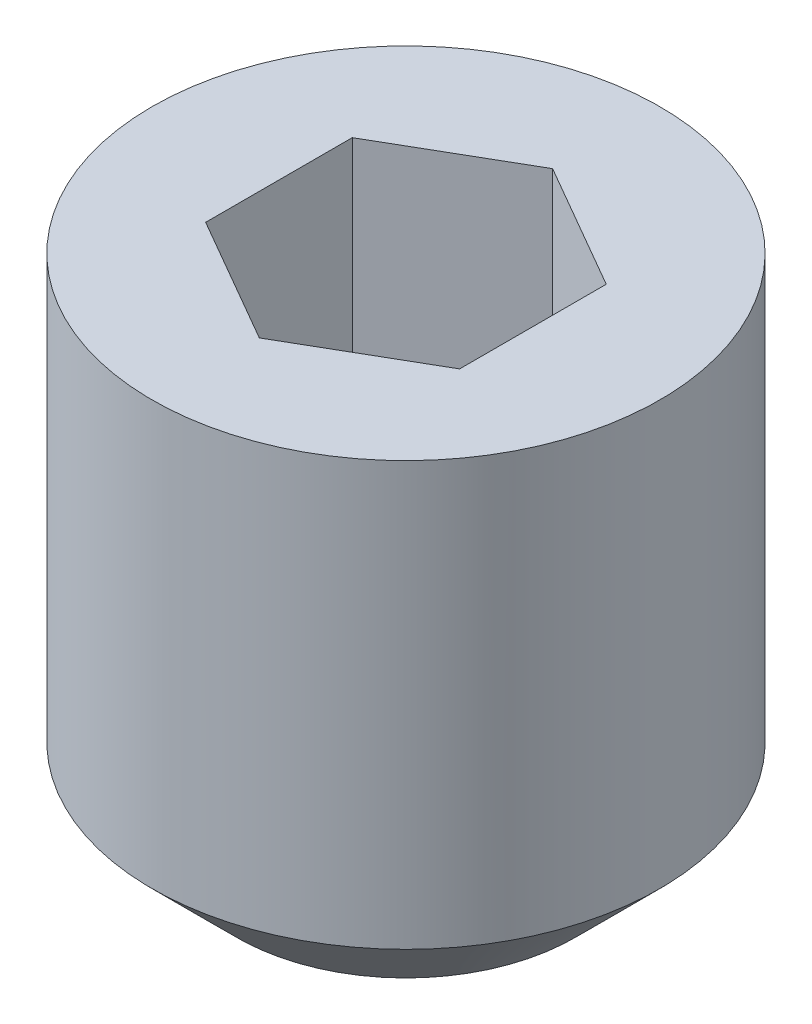
ISO-10303-21;
HEADER;
FILE_DESCRIPTION(('STEP AP214'),'2;1');
FILE_NAME('part.step','',(''),(''),'','','');
FILE_SCHEMA(('AUTOMOTIVE_DESIGN { 1 0 10303 214 1 1 1 1 }'));
ENDSEC;
DATA;
#1=APPLICATION_CONTEXT('core data for automotive mechanical design processes');
#2=APPLICATION_PROTOCOL_DEFINITION('international standard','automotive_design',2000,#1);
#3=PRODUCT_CONTEXT('',#1,'mechanical');
#4=PRODUCT('Part','Part','',(#3));
#5=PRODUCT_RELATED_PRODUCT_CATEGORY('part','',(#4));
#6=PRODUCT_DEFINITION_FORMATION('','',#4);
#7=PRODUCT_DEFINITION_CONTEXT('part definition',#1,'design');
#8=PRODUCT_DEFINITION('design','',#6,#7);
#9=PRODUCT_DEFINITION_SHAPE('','',#8);
#10=(LENGTH_UNIT() NAMED_UNIT(*) SI_UNIT(.MILLI.,.METRE.));
#11=(NAMED_UNIT(*) PLANE_ANGLE_UNIT() SI_UNIT($,.RADIAN.));
#12=(NAMED_UNIT(*) SI_UNIT($,.STERADIAN.) SOLID_ANGLE_UNIT());
#13=UNCERTAINTY_MEASURE_WITH_UNIT(LENGTH_MEASURE(1.E-05),#10,'distance_accuracy_value','');
#14=(GEOMETRIC_REPRESENTATION_CONTEXT(3) GLOBAL_UNCERTAINTY_ASSIGNED_CONTEXT((#13)) GLOBAL_UNIT_ASSIGNED_CONTEXT((#10,
#11,#12)) REPRESENTATION_CONTEXT('',''));
#15=CARTESIAN_POINT('',(0.,0.,0.));
#16=DIRECTION('',(0.,0.,1.));
#17=DIRECTION('',(1.,0.,0.));
#18=AXIS2_PLACEMENT_3D('',#15,#16,#17);
#19=CARTESIAN_POINT('',(0.,3.,0.));
#20=DIRECTION('',(0.,-1.,0.));
#21=DIRECTION('',(1.,0.,0.));
#22=AXIS2_PLACEMENT_3D('',#19,#20,#21);
#23=PLANE('',#22);
#24=CARTESIAN_POINT('',(0.,3.,0.));
#25=DIRECTION('',(0.,1.,0.));
#26=DIRECTION('',(-1.,0.,0.));
#27=AXIS2_PLACEMENT_3D('',#24,#25,#26);
#28=CIRCLE('',#27,1.5);
#29=CARTESIAN_POINT('',(-1.5,3.,0.));
#30=VERTEX_POINT('',#29);
#31=EDGE_CURVE('E11',#30,#30,#28,.T.);
#32=ORIENTED_EDGE('',*,*,#31,.T.);
#33=EDGE_LOOP('',(#32));
#34=FACE_BOUND('',#33,.T.);
#35=DIRECTION('',(-0.866025403784438,0.,0.500000000000001));
#36=VECTOR('',#35,1.);
#37=CARTESIAN_POINT('',(0.,3.,-0.866025403784439));
#38=LINE('',#37,#36);
#39=CARTESIAN_POINT('',(0.,3.,-0.866025403784439));
#40=VERTEX_POINT('',#39);
#41=CARTESIAN_POINT('',(-0.75,3.,-0.433012701892219));
#42=VERTEX_POINT('',#41);
#43=EDGE_CURVE('E183',#40,#42,#38,.T.);
#44=ORIENTED_EDGE('',*,*,#43,.F.);
#45=DIRECTION('',(-0.866025403784439,0.,-0.499999999999999));
#46=VECTOR('',#45,1.);
#47=CARTESIAN_POINT('',(0.75,3.,-0.43301270189222));
#48=LINE('',#47,#46);
#49=CARTESIAN_POINT('',(0.75,3.,-0.43301270189222));
#50=VERTEX_POINT('',#49);
#51=EDGE_CURVE('E57',#50,#40,#48,.T.);
#52=ORIENTED_EDGE('',*,*,#51,.F.);
#53=DIRECTION('',(0.,0.,-1.));
#54=VECTOR('',#53,1.);
#55=CARTESIAN_POINT('',(0.75,3.,0.433012701892219));
#56=LINE('',#55,#54);
#57=CARTESIAN_POINT('',(0.75,3.,0.433012701892219));
#58=VERTEX_POINT('',#57);
#59=EDGE_CURVE('E144',#58,#50,#56,.T.);
#60=ORIENTED_EDGE('',*,*,#59,.F.);
#61=DIRECTION('',(0.866025403784438,0.,-0.5));
#62=VECTOR('',#61,1.);
#63=CARTESIAN_POINT('',(0.,3.,0.866025403784438));
#64=LINE('',#63,#62);
#65=CARTESIAN_POINT('',(0.,3.,0.866025403784438));
#66=VERTEX_POINT('',#65);
#67=EDGE_CURVE('E194',#66,#58,#64,.T.);
#68=ORIENTED_EDGE('',*,*,#67,.F.);
#69=DIRECTION('',(0.866025403784439,0.,0.5));
#70=VECTOR('',#69,1.);
#71=CARTESIAN_POINT('',(-0.75,3.,0.433012701892219));
#72=LINE('',#71,#70);
#73=CARTESIAN_POINT('',(-0.75,3.,0.433012701892219));
#74=VERTEX_POINT('',#73);
#75=EDGE_CURVE('E190',#74,#66,#72,.T.);
#76=ORIENTED_EDGE('',*,*,#75,.F.);
#77=DIRECTION('',(0.,0.,1.));
#78=VECTOR('',#77,1.);
#79=CARTESIAN_POINT('',(-0.75,3.,-0.433012701892219));
#80=LINE('',#79,#78);
#81=EDGE_CURVE('E187',#42,#74,#80,.T.);
#82=ORIENTED_EDGE('',*,*,#81,.F.);
#83=EDGE_LOOP('',(#44,#52,#60,#68,#76,#82));
#84=FACE_BOUND('',#83,.T.);
#85=ADVANCED_FACE('F39',(#34,#84),#23,.F.);
#86=CARTESIAN_POINT('',(0.,3.,0.));
#87=DIRECTION('',(0.,1.,0.));
#88=DIRECTION('',(-1.,0.,0.));
#89=AXIS2_PLACEMENT_3D('',#86,#87,#88);
#90=CYLINDRICAL_SURFACE('',#89,1.5);
#91=CARTESIAN_POINT('',(0.,0.499999999999995,0.));
#92=DIRECTION('',(0.,-1.,0.));
#93=DIRECTION('',(0.,0.,-1.));
#94=AXIS2_PLACEMENT_3D('',#91,#92,#93);
#95=CIRCLE('',#94,1.5);
#96=CARTESIAN_POINT('',(0.,0.499999999999995,-1.5));
#97=VERTEX_POINT('',#96);
#98=EDGE_CURVE('E412',#97,#97,#95,.T.);
#99=ORIENTED_EDGE('',*,*,#98,.F.);
#100=EDGE_LOOP('',(#99));
#101=FACE_BOUND('',#100,.T.);
#102=ORIENTED_EDGE('',*,*,#31,.F.);
#103=EDGE_LOOP('',(#102));
#104=FACE_BOUND('',#103,.T.);
#105=ADVANCED_FACE('F272',(#101,#104),#90,.T.);
#106=CARTESIAN_POINT('',(0.75,1.8,-0.43301270189222));
#107=DIRECTION('',(0.499999999999999,0.,-0.866025403784439));
#108=DIRECTION('',(-0.866025403784439,0.,-0.499999999999999));
#109=AXIS2_PLACEMENT_3D('',#106,#107,#108);
#110=PLANE('',#109);
#111=DIRECTION('',(-0.866025403784439,0.,-0.499999999999999));
#112=VECTOR('',#111,1.);
#113=CARTESIAN_POINT('',(0.75,1.8,-0.43301270189222));
#114=LINE('',#113,#112);
#115=CARTESIAN_POINT('',(0.75,1.8,-0.43301270189222));
#116=VERTEX_POINT('',#115);
#117=CARTESIAN_POINT('',(0.375,1.8,-0.649519052838329));
#118=VERTEX_POINT('',#117);
#119=EDGE_CURVE('E143',#116,#118,#114,.T.);
#120=ORIENTED_EDGE('',*,*,#119,.F.);
#121=DIRECTION('',(0.,1.,0.));
#122=VECTOR('',#121,1.);
#123=CARTESIAN_POINT('',(0.75,1.8,-0.43301270189222));
#124=LINE('',#123,#122);
#125=EDGE_CURVE('E199',#116,#50,#124,.T.);
#126=ORIENTED_EDGE('',*,*,#125,.T.);
#127=ORIENTED_EDGE('',*,*,#51,.T.);
#128=DIRECTION('',(0.,1.,0.));
#129=VECTOR('',#128,1.);
#130=CARTESIAN_POINT('',(0.,1.8,-0.866025403784439));
#131=LINE('',#130,#129);
#132=CARTESIAN_POINT('',(0.,1.8,-0.866025403784439));
#133=VERTEX_POINT('',#132);
#134=EDGE_CURVE('E146',#133,#40,#131,.T.);
#135=ORIENTED_EDGE('',*,*,#134,.F.);
#136=EDGE_CURVE('E134',#118,#133,#114,.T.);
#137=ORIENTED_EDGE('',*,*,#136,.F.);
#138=EDGE_LOOP('',(#120,#126,#127,#135,#137));
#139=FACE_BOUND('',#138,.T.);
#140=ADVANCED_FACE('F147',(#139),#110,.F.);
#141=CARTESIAN_POINT('',(0.75,1.8,0.433012701892219));
#142=DIRECTION('',(1.,0.,0.));
#143=DIRECTION('',(0.,0.,-1.));
#144=AXIS2_PLACEMENT_3D('',#141,#142,#143);
#145=PLANE('',#144);
#146=DIRECTION('',(0.,0.,-1.));
#147=VECTOR('',#146,1.);
#148=CARTESIAN_POINT('',(0.75,1.8,0.433012701892219));
#149=LINE('',#148,#147);
#150=CARTESIAN_POINT('',(0.75,1.8,0.433012701892219));
#151=VERTEX_POINT('',#150);
#152=CARTESIAN_POINT('',(0.75,1.8,0.));
#153=VERTEX_POINT('',#152);
#154=EDGE_CURVE('E152',#151,#153,#149,.T.);
#155=ORIENTED_EDGE('',*,*,#154,.F.);
#156=DIRECTION('',(0.,1.,0.));
#157=VECTOR('',#156,1.);
#158=CARTESIAN_POINT('',(0.75,1.8,0.433012701892219));
#159=LINE('',#158,#157);
#160=EDGE_CURVE('E203',#151,#58,#159,.T.);
#161=ORIENTED_EDGE('',*,*,#160,.T.);
#162=ORIENTED_EDGE('',*,*,#59,.T.);
#163=ORIENTED_EDGE('',*,*,#125,.F.);
#164=EDGE_CURVE('E177',#153,#116,#149,.T.);
#165=ORIENTED_EDGE('',*,*,#164,.F.);
#166=EDGE_LOOP('',(#155,#161,#162,#163,#165));
#167=FACE_BOUND('',#166,.T.);
#168=ADVANCED_FACE('F244',(#167),#145,.F.);
#169=CARTESIAN_POINT('',(0.,1.8,0.866025403784438));
#170=DIRECTION('',(0.500000000000001,0.,0.866025403784438));
#171=DIRECTION('',(0.866025403784438,0.,-0.500000000000001));
#172=AXIS2_PLACEMENT_3D('',#169,#170,#171);
#173=PLANE('',#172);
#174=DIRECTION('',(0.866025403784438,0.,-0.5));
#175=VECTOR('',#174,1.);
#176=CARTESIAN_POINT('',(0.,1.8,0.866025403784438));
#177=LINE('',#176,#175);
#178=CARTESIAN_POINT('',(0.,1.8,0.866025403784438));
#179=VERTEX_POINT('',#178);
#180=CARTESIAN_POINT('',(0.375000000000001,1.8,0.649519052838329));
#181=VERTEX_POINT('',#180);
#182=EDGE_CURVE('E68',#179,#181,#177,.T.);
#183=ORIENTED_EDGE('',*,*,#182,.F.);
#184=DIRECTION('',(0.,1.,0.));
#185=VECTOR('',#184,1.);
#186=CARTESIAN_POINT('',(0.,1.8,0.866025403784438));
#187=LINE('',#186,#185);
#188=EDGE_CURVE('E207',#179,#66,#187,.T.);
#189=ORIENTED_EDGE('',*,*,#188,.T.);
#190=ORIENTED_EDGE('',*,*,#67,.T.);
#191=ORIENTED_EDGE('',*,*,#160,.F.);
#192=EDGE_CURVE('E174',#181,#151,#177,.T.);
#193=ORIENTED_EDGE('',*,*,#192,.F.);
#194=EDGE_LOOP('',(#183,#189,#190,#191,#193));
#195=FACE_BOUND('',#194,.T.);
#196=ADVANCED_FACE('F300',(#195),#173,.F.);
#197=CARTESIAN_POINT('',(-0.75,1.8,0.433012701892219));
#198=DIRECTION('',(-0.5,0.,0.866025403784439));
#199=DIRECTION('',(0.866025403784439,0.,0.5));
#200=AXIS2_PLACEMENT_3D('',#197,#198,#199);
#201=PLANE('',#200);
#202=DIRECTION('',(0.866025403784439,0.,0.5));
#203=VECTOR('',#202,1.);
#204=CARTESIAN_POINT('',(-0.75,1.8,0.433012701892219));
#205=LINE('',#204,#203);
#206=CARTESIAN_POINT('',(-0.75,1.8,0.433012701892219));
#207=VERTEX_POINT('',#206);
#208=CARTESIAN_POINT('',(-0.375,1.8,0.649519052838329));
#209=VERTEX_POINT('',#208);
#210=EDGE_CURVE('E170',#207,#209,#205,.T.);
#211=ORIENTED_EDGE('',*,*,#210,.F.);
#212=DIRECTION('',(0.,1.,0.));
#213=VECTOR('',#212,1.);
#214=CARTESIAN_POINT('',(-0.75,1.8,0.433012701892219));
#215=LINE('',#214,#213);
#216=EDGE_CURVE('E211',#207,#74,#215,.T.);
#217=ORIENTED_EDGE('',*,*,#216,.T.);
#218=ORIENTED_EDGE('',*,*,#75,.T.);
#219=ORIENTED_EDGE('',*,*,#188,.F.);
#220=EDGE_CURVE('E169',#209,#179,#205,.T.);
#221=ORIENTED_EDGE('',*,*,#220,.F.);
#222=EDGE_LOOP('',(#211,#217,#218,#219,#221));
#223=FACE_BOUND('',#222,.T.);
#224=ADVANCED_FACE('F297',(#223),#201,.F.);
#225=CARTESIAN_POINT('',(-0.75,1.8,-0.433012701892219));
#226=DIRECTION('',(-1.,0.,0.));
#227=DIRECTION('',(0.,-1.,0.));
#228=AXIS2_PLACEMENT_3D('',#225,#226,#227);
#229=PLANE('',#228);
#230=DIRECTION('',(0.,0.,1.));
#231=VECTOR('',#230,1.);
#232=CARTESIAN_POINT('',(-0.75,1.8,-0.433012701892219));
#233=LINE('',#232,#231);
#234=CARTESIAN_POINT('',(-0.75,1.8,-0.433012701892219));
#235=VERTEX_POINT('',#234);
#236=CARTESIAN_POINT('',(-0.75,1.8,0.));
#237=VERTEX_POINT('',#236);
#238=EDGE_CURVE('E163',#235,#237,#233,.T.);
#239=ORIENTED_EDGE('',*,*,#238,.F.);
#240=DIRECTION('',(0.,1.,0.));
#241=VECTOR('',#240,1.);
#242=CARTESIAN_POINT('',(-0.75,1.8,-0.433012701892219));
#243=LINE('',#242,#241);
#244=EDGE_CURVE('E151',#235,#42,#243,.T.);
#245=ORIENTED_EDGE('',*,*,#244,.T.);
#246=ORIENTED_EDGE('',*,*,#81,.T.);
#247=ORIENTED_EDGE('',*,*,#216,.F.);
#248=EDGE_CURVE('E159',#237,#207,#233,.T.);
#249=ORIENTED_EDGE('',*,*,#248,.F.);
#250=EDGE_LOOP('',(#239,#245,#246,#247,#249));
#251=FACE_BOUND('',#250,.T.);
#252=ADVANCED_FACE('F255',(#251),#229,.F.);
#253=CARTESIAN_POINT('',(0.,1.8,-0.866025403784439));
#254=DIRECTION('',(-0.500000000000001,0.,-0.866025403784438));
#255=DIRECTION('',(-0.866025403784438,0.,0.500000000000001));
#256=AXIS2_PLACEMENT_3D('',#253,#254,#255);
#257=PLANE('',#256);
#258=DIRECTION('',(-0.866025403784438,0.,0.500000000000001));
#259=VECTOR('',#258,1.);
#260=CARTESIAN_POINT('',(0.,1.8,-0.866025403784439));
#261=LINE('',#260,#259);
#262=CARTESIAN_POINT('',(-0.375,1.8,-0.649519052838329));
#263=VERTEX_POINT('',#262);
#264=EDGE_CURVE('E137',#133,#263,#261,.T.);
#265=ORIENTED_EDGE('',*,*,#264,.F.);
#266=ORIENTED_EDGE('',*,*,#134,.T.);
#267=ORIENTED_EDGE('',*,*,#43,.T.);
#268=ORIENTED_EDGE('',*,*,#244,.F.);
#269=EDGE_CURVE('E157',#263,#235,#261,.T.);
#270=ORIENTED_EDGE('',*,*,#269,.F.);
#271=EDGE_LOOP('',(#265,#266,#267,#268,#270));
#272=FACE_BOUND('',#271,.T.);
#273=ADVANCED_FACE('F155',(#272),#257,.F.);
#274=CARTESIAN_POINT('',(0.,1.8,0.));
#275=DIRECTION('',(0.,1.,0.));
#276=DIRECTION('',(0.,0.,1.));
#277=AXIS2_PLACEMENT_3D('',#274,#275,#276);
#278=PLANE('',#277);
#279=ORIENTED_EDGE('',*,*,#192,.T.);
#280=ORIENTED_EDGE('',*,*,#154,.T.);
#281=CARTESIAN_POINT('',(0.,1.8,0.));
#282=DIRECTION('',(0.,1.,0.));
#283=DIRECTION('',(-1.,0.,0.));
#284=AXIS2_PLACEMENT_3D('',#281,#282,#283);
#285=CIRCLE('',#284,0.75);
#286=EDGE_CURVE('E224',#181,#153,#285,.T.);
#287=ORIENTED_EDGE('',*,*,#286,.F.);
#288=EDGE_LOOP('',(#279,#280,#287));
#289=FACE_BOUND('',#288,.T.);
#290=ADVANCED_FACE('F239',(#289),#278,.T.);
#291=ORIENTED_EDGE('',*,*,#164,.T.);
#292=ORIENTED_EDGE('',*,*,#119,.T.);
#293=EDGE_CURVE('E227',#153,#118,#285,.T.);
#294=ORIENTED_EDGE('',*,*,#293,.F.);
#295=EDGE_LOOP('',(#291,#292,#294));
#296=FACE_BOUND('',#295,.T.);
#297=ADVANCED_FACE('F249',(#296),#278,.T.);
#298=ORIENTED_EDGE('',*,*,#136,.T.);
#299=ORIENTED_EDGE('',*,*,#264,.T.);
#300=EDGE_CURVE('E139',#118,#263,#285,.T.);
#301=ORIENTED_EDGE('',*,*,#300,.F.);
#302=EDGE_LOOP('',(#298,#299,#301));
#303=FACE_BOUND('',#302,.T.);
#304=ADVANCED_FACE('F135',(#303),#278,.T.);
#305=ORIENTED_EDGE('',*,*,#269,.T.);
#306=ORIENTED_EDGE('',*,*,#238,.T.);
#307=EDGE_CURVE('E202',#263,#237,#285,.T.);
#308=ORIENTED_EDGE('',*,*,#307,.F.);
#309=EDGE_LOOP('',(#305,#306,#308));
#310=FACE_BOUND('',#309,.T.);
#311=ADVANCED_FACE('F259',(#310),#278,.T.);
#312=ORIENTED_EDGE('',*,*,#248,.T.);
#313=ORIENTED_EDGE('',*,*,#210,.T.);
#314=EDGE_CURVE('E47',#237,#209,#285,.T.);
#315=ORIENTED_EDGE('',*,*,#314,.F.);
#316=EDGE_LOOP('',(#312,#313,#315));
#317=FACE_BOUND('',#316,.T.);
#318=ADVANCED_FACE('F261',(#317),#278,.T.);
#319=ORIENTED_EDGE('',*,*,#220,.T.);
#320=ORIENTED_EDGE('',*,*,#182,.T.);
#321=EDGE_CURVE('E219',#209,#181,#285,.T.);
#322=ORIENTED_EDGE('',*,*,#321,.F.);
#323=EDGE_LOOP('',(#319,#320,#322));
#324=FACE_BOUND('',#323,.T.);
#325=ADVANCED_FACE('F267',(#324),#278,.T.);
#326=CARTESIAN_POINT('',(0.,1.36698729810778,0.));
#327=DIRECTION('',(0.,1.,0.));
#328=DIRECTION('',(-1.,0.,0.));
#329=AXIS2_PLACEMENT_3D('',#326,#327,#328);
#330=CONICAL_SURFACE('',#329,0.,1.0471975511966);
#331=ORIENTED_EDGE('',*,*,#314,.T.);
#332=ORIENTED_EDGE('',*,*,#321,.T.);
#333=ORIENTED_EDGE('',*,*,#286,.T.);
#334=ORIENTED_EDGE('',*,*,#293,.T.);
#335=ORIENTED_EDGE('',*,*,#300,.T.);
#336=ORIENTED_EDGE('',*,*,#307,.T.);
#337=EDGE_LOOP('',(#331,#332,#333,#334,#335,#336));
#338=FACE_BOUND('',#337,.T.);
#339=CARTESIAN_POINT('',(0.,1.36698729810778,0.));
#340=VERTEX_POINT('',#339);
#341=VERTEX_LOOP('',#340);
#342=FACE_BOUND('',#341,.T.);
#343=ADVANCED_FACE('F236',(#338,#342),#330,.F.);
#344=CARTESIAN_POINT('',(0.,0.499999999999995,0.));
#345=DIRECTION('',(0.,1.,0.));
#346=DIRECTION('',(0.,0.,1.));
#347=AXIS2_PLACEMENT_3D('',#344,#345,#346);
#348=CONICAL_SURFACE('',#347,1.5,0.785398163397454);
#349=CARTESIAN_POINT('',(0.,0.,0.));
#350=DIRECTION('',(0.,-1.,0.));
#351=DIRECTION('',(0.,0.,-1.));
#352=AXIS2_PLACEMENT_3D('',#349,#350,#351);
#353=CIRCLE('',#352,1.);
#354=CARTESIAN_POINT('',(0.,0.,-1.));
#355=VERTEX_POINT('',#354);
#356=EDGE_CURVE('E184',#355,#355,#353,.T.);
#357=ORIENTED_EDGE('',*,*,#356,.F.);
#358=EDGE_LOOP('',(#357));
#359=FACE_BOUND('',#358,.T.);
#360=ORIENTED_EDGE('',*,*,#98,.T.);
#361=EDGE_LOOP('',(#360));
#362=FACE_BOUND('',#361,.T.);
#363=ADVANCED_FACE('F289',(#359,#362),#348,.T.);
#364=CARTESIAN_POINT('',(1.5,0.,0.));
#365=DIRECTION('',(0.,1.,0.));
#366=DIRECTION('',(-1.,0.,0.));
#367=AXIS2_PLACEMENT_3D('',#364,#365,#366);
#368=PLANE('',#367);
#369=ORIENTED_EDGE('',*,*,#356,.T.);
#370=EDGE_LOOP('',(#369));
#371=FACE_BOUND('',#370,.T.);
#372=ADVANCED_FACE('F286',(#371),#368,.F.);
#373=CLOSED_SHELL('',(#85,#105,#140,#168,#196,#224,#252,#273,#290,#297,#304,#311,#318,#325,#343,
#363,#372));
#374=MANIFOLD_SOLID_BREP('B2',#373);
#375=ADVANCED_BREP_SHAPE_REPRESENTATION('',(#18,#374),#14);
#376=SHAPE_DEFINITION_REPRESENTATION(#9,#375);
ENDSEC;
END-ISO-10303-21;
